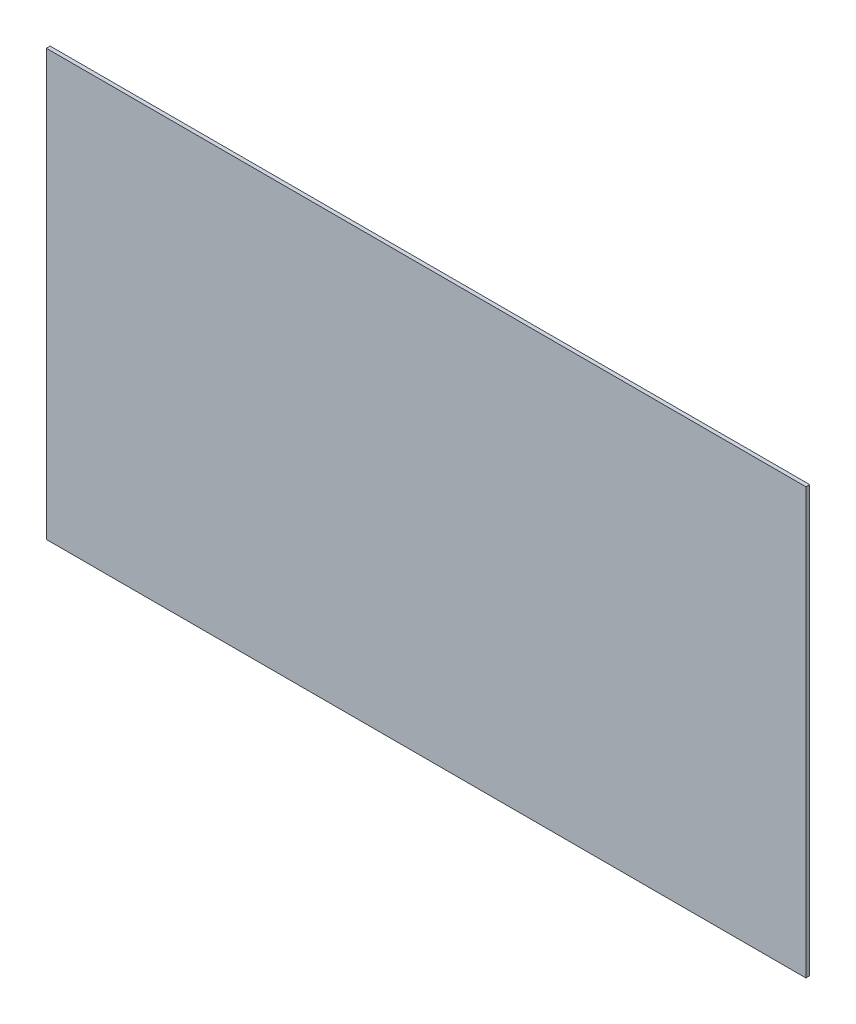
ISO-10303-21;
HEADER;
FILE_DESCRIPTION(('STEP AP214'),'2;1');
FILE_NAME('part.step','',(''),(''),'','','');
FILE_SCHEMA(('AUTOMOTIVE_DESIGN { 1 0 10303 214 1 1 1 1 }'));
ENDSEC;
DATA;
#1=APPLICATION_CONTEXT('core data for automotive mechanical design processes');
#2=APPLICATION_PROTOCOL_DEFINITION('international standard','automotive_design',2000,#1);
#3=PRODUCT_CONTEXT('',#1,'mechanical');
#4=PRODUCT('Part','Part','',(#3));
#5=PRODUCT_RELATED_PRODUCT_CATEGORY('part','',(#4));
#6=PRODUCT_DEFINITION_FORMATION('','',#4);
#7=PRODUCT_DEFINITION_CONTEXT('part definition',#1,'design');
#8=PRODUCT_DEFINITION('design','',#6,#7);
#9=PRODUCT_DEFINITION_SHAPE('','',#8);
#10=(LENGTH_UNIT() NAMED_UNIT(*) SI_UNIT(.MILLI.,.METRE.));
#11=(NAMED_UNIT(*) PLANE_ANGLE_UNIT() SI_UNIT($,.RADIAN.));
#12=(NAMED_UNIT(*) SI_UNIT($,.STERADIAN.) SOLID_ANGLE_UNIT());
#13=UNCERTAINTY_MEASURE_WITH_UNIT(LENGTH_MEASURE(1.E-05),#10,'distance_accuracy_value','');
#14=(GEOMETRIC_REPRESENTATION_CONTEXT(3) GLOBAL_UNCERTAINTY_ASSIGNED_CONTEXT((#13)) GLOBAL_UNIT_ASSIGNED_CONTEXT((#10,
#11,#12)) REPRESENTATION_CONTEXT('',''));
#15=CARTESIAN_POINT('',(0.,0.,0.));
#16=DIRECTION('',(0.,0.,1.));
#17=DIRECTION('',(1.,0.,0.));
#18=AXIS2_PLACEMENT_3D('',#15,#16,#17);
#19=CARTESIAN_POINT('',(0.,0.,3.));
#20=DIRECTION('',(1.,0.,0.));
#21=DIRECTION('',(0.,1.,0.));
#22=AXIS2_PLACEMENT_3D('',#19,#20,#21);
#23=PLANE('',#22);
#24=DIRECTION('',(0.,-1.,0.));
#25=VECTOR('',#24,1.);
#26=CARTESIAN_POINT('',(0.,0.,0.));
#27=LINE('',#26,#25);
#28=CARTESIAN_POINT('',(0.,0.,0.));
#29=VERTEX_POINT('',#28);
#30=CARTESIAN_POINT('',(0.,-336.,0.));
#31=VERTEX_POINT('',#30);
#32=EDGE_CURVE('E107',#29,#31,#27,.T.);
#33=ORIENTED_EDGE('',*,*,#32,.T.);
#34=DIRECTION('',(0.,0.,-1.));
#35=VECTOR('',#34,1.);
#36=CARTESIAN_POINT('',(0.,-336.,3.));
#37=LINE('',#36,#35);
#38=CARTESIAN_POINT('',(0.,-336.,3.));
#39=VERTEX_POINT('',#38);
#40=EDGE_CURVE('E11',#39,#31,#37,.T.);
#41=ORIENTED_EDGE('',*,*,#40,.F.);
#42=DIRECTION('',(0.,-1.,0.));
#43=VECTOR('',#42,1.);
#44=CARTESIAN_POINT('',(0.,0.,3.));
#45=LINE('',#44,#43);
#46=CARTESIAN_POINT('',(0.,0.,3.));
#47=VERTEX_POINT('',#46);
#48=EDGE_CURVE('E91',#47,#39,#45,.T.);
#49=ORIENTED_EDGE('',*,*,#48,.F.);
#50=DIRECTION('',(0.,0.,-1.));
#51=VECTOR('',#50,1.);
#52=CARTESIAN_POINT('',(0.,0.,3.));
#53=LINE('',#52,#51);
#54=EDGE_CURVE('E103',#47,#29,#53,.T.);
#55=ORIENTED_EDGE('',*,*,#54,.T.);
#56=EDGE_LOOP('',(#33,#41,#49,#55));
#57=FACE_BOUND('',#56,.T.);
#58=ADVANCED_FACE('F39',(#57),#23,.F.);
#59=CARTESIAN_POINT('',(0.,-336.,3.));
#60=DIRECTION('',(0.,1.,0.));
#61=DIRECTION('',(0.,0.,1.));
#62=AXIS2_PLACEMENT_3D('',#59,#60,#61);
#63=PLANE('',#62);
#64=DIRECTION('',(1.,0.,0.));
#65=VECTOR('',#64,1.);
#66=CARTESIAN_POINT('',(0.,-336.,0.));
#67=LINE('',#66,#65);
#68=CARTESIAN_POINT('',(600.,-336.,0.));
#69=VERTEX_POINT('',#68);
#70=EDGE_CURVE('E96',#31,#69,#67,.T.);
#71=ORIENTED_EDGE('',*,*,#70,.T.);
#72=DIRECTION('',(0.,0.,-1.));
#73=VECTOR('',#72,1.);
#74=CARTESIAN_POINT('',(600.,-336.,3.));
#75=LINE('',#74,#73);
#76=CARTESIAN_POINT('',(600.,-336.,3.));
#77=VERTEX_POINT('',#76);
#78=EDGE_CURVE('E48',#77,#69,#75,.T.);
#79=ORIENTED_EDGE('',*,*,#78,.F.);
#80=DIRECTION('',(1.,0.,0.));
#81=VECTOR('',#80,1.);
#82=CARTESIAN_POINT('',(0.,-336.,3.));
#83=LINE('',#82,#81);
#84=EDGE_CURVE('E86',#39,#77,#83,.T.);
#85=ORIENTED_EDGE('',*,*,#84,.F.);
#86=ORIENTED_EDGE('',*,*,#40,.T.);
#87=EDGE_LOOP('',(#71,#79,#85,#86));
#88=FACE_BOUND('',#87,.T.);
#89=ADVANCED_FACE('F95',(#88),#63,.F.);
#90=CARTESIAN_POINT('',(600.,0.,3.));
#91=DIRECTION('',(-1.,0.,0.));
#92=DIRECTION('',(0.,0.,1.));
#93=AXIS2_PLACEMENT_3D('',#90,#91,#92);
#94=PLANE('',#93);
#95=DIRECTION('',(0.,1.,0.));
#96=VECTOR('',#95,1.);
#97=CARTESIAN_POINT('',(600.,0.,0.));
#98=LINE('',#97,#96);
#99=CARTESIAN_POINT('',(600.,0.,0.));
#100=VERTEX_POINT('',#99);
#101=EDGE_CURVE('E73',#69,#100,#98,.T.);
#102=ORIENTED_EDGE('',*,*,#101,.T.);
#103=DIRECTION('',(0.,0.,-1.));
#104=VECTOR('',#103,1.);
#105=CARTESIAN_POINT('',(600.,0.,3.));
#106=LINE('',#105,#104);
#107=CARTESIAN_POINT('',(600.,0.,3.));
#108=VERTEX_POINT('',#107);
#109=EDGE_CURVE('E98',#108,#100,#106,.T.);
#110=ORIENTED_EDGE('',*,*,#109,.F.);
#111=DIRECTION('',(0.,1.,0.));
#112=VECTOR('',#111,1.);
#113=CARTESIAN_POINT('',(600.,0.,3.));
#114=LINE('',#113,#112);
#115=EDGE_CURVE('E89',#77,#108,#114,.T.);
#116=ORIENTED_EDGE('',*,*,#115,.F.);
#117=ORIENTED_EDGE('',*,*,#78,.T.);
#118=EDGE_LOOP('',(#102,#110,#116,#117));
#119=FACE_BOUND('',#118,.T.);
#120=ADVANCED_FACE('F99',(#119),#94,.F.);
#121=CARTESIAN_POINT('',(0.,0.,3.));
#122=DIRECTION('',(0.,-1.,0.));
#123=DIRECTION('',(0.,0.,-1.));
#124=AXIS2_PLACEMENT_3D('',#121,#122,#123);
#125=PLANE('',#124);
#126=DIRECTION('',(-1.,0.,0.));
#127=VECTOR('',#126,1.);
#128=CARTESIAN_POINT('',(0.,0.,0.));
#129=LINE('',#128,#127);
#130=EDGE_CURVE('E79',#100,#29,#129,.T.);
#131=ORIENTED_EDGE('',*,*,#130,.T.);
#132=ORIENTED_EDGE('',*,*,#54,.F.);
#133=DIRECTION('',(-1.,0.,0.));
#134=VECTOR('',#133,1.);
#135=CARTESIAN_POINT('',(0.,0.,3.));
#136=LINE('',#135,#134);
#137=EDGE_CURVE('E56',#108,#47,#136,.T.);
#138=ORIENTED_EDGE('',*,*,#137,.F.);
#139=ORIENTED_EDGE('',*,*,#109,.T.);
#140=EDGE_LOOP('',(#131,#132,#138,#139));
#141=FACE_BOUND('',#140,.T.);
#142=ADVANCED_FACE('F120',(#141),#125,.F.);
#143=CARTESIAN_POINT('',(0.,0.,3.));
#144=DIRECTION('',(0.,0.,1.));
#145=DIRECTION('',(1.,0.,0.));
#146=AXIS2_PLACEMENT_3D('',#143,#144,#145);
#147=PLANE('',#146);
#148=ORIENTED_EDGE('',*,*,#48,.T.);
#149=ORIENTED_EDGE('',*,*,#84,.T.);
#150=ORIENTED_EDGE('',*,*,#115,.T.);
#151=ORIENTED_EDGE('',*,*,#137,.T.);
#152=EDGE_LOOP('',(#148,#149,#150,#151));
#153=FACE_BOUND('',#152,.T.);
#154=ADVANCED_FACE('F87',(#153),#147,.T.);
#155=CARTESIAN_POINT('',(0.,0.,0.));
#156=DIRECTION('',(0.,0.,1.));
#157=DIRECTION('',(1.,0.,0.));
#158=AXIS2_PLACEMENT_3D('',#155,#156,#157);
#159=PLANE('',#158);
#160=ORIENTED_EDGE('',*,*,#32,.F.);
#161=ORIENTED_EDGE('',*,*,#130,.F.);
#162=ORIENTED_EDGE('',*,*,#101,.F.);
#163=ORIENTED_EDGE('',*,*,#70,.F.);
#164=EDGE_LOOP('',(#160,#161,#162,#163));
#165=FACE_BOUND('',#164,.T.);
#166=ADVANCED_FACE('F123',(#165),#159,.F.);
#167=CLOSED_SHELL('',(#58,#89,#120,#142,#154,#166));
#168=MANIFOLD_SOLID_BREP('B2',#167);
#169=ADVANCED_BREP_SHAPE_REPRESENTATION('',(#18,#168),#14);
#170=SHAPE_DEFINITION_REPRESENTATION(#9,#169);
ENDSEC;
END-ISO-10303-21;
